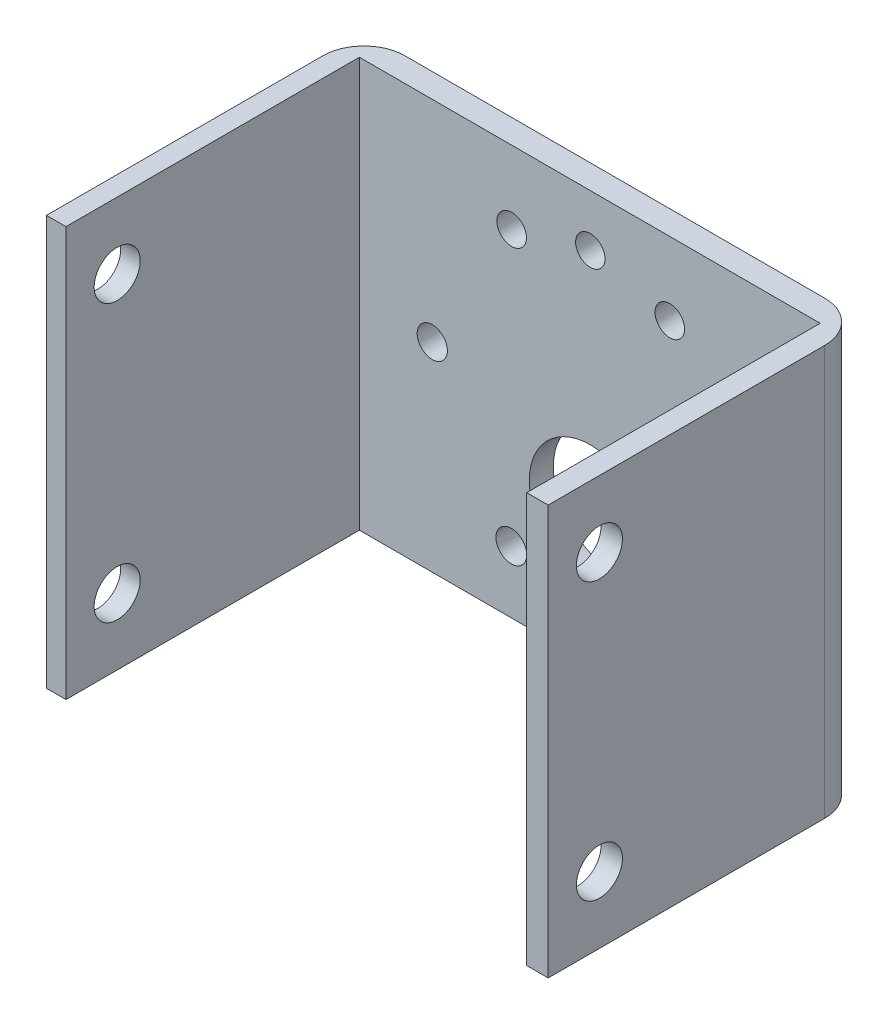
ISO-10303-21;
HEADER;
FILE_DESCRIPTION(('STEP AP214'),'2;1');
FILE_NAME('part.step','',(''),(''),'','','');
FILE_SCHEMA(('AUTOMOTIVE_DESIGN { 1 0 10303 214 1 1 1 1 }'));
ENDSEC;
DATA;
#1=APPLICATION_CONTEXT('core data for automotive mechanical design processes');
#2=APPLICATION_PROTOCOL_DEFINITION('international standard','automotive_design',2000,#1);
#3=PRODUCT_CONTEXT('',#1,'mechanical');
#4=PRODUCT('Part','Part','',(#3));
#5=PRODUCT_RELATED_PRODUCT_CATEGORY('part','',(#4));
#6=PRODUCT_DEFINITION_FORMATION('','',#4);
#7=PRODUCT_DEFINITION_CONTEXT('part definition',#1,'design');
#8=PRODUCT_DEFINITION('design','',#6,#7);
#9=PRODUCT_DEFINITION_SHAPE('','',#8);
#10=(LENGTH_UNIT() NAMED_UNIT(*) SI_UNIT(.MILLI.,.METRE.));
#11=(NAMED_UNIT(*) PLANE_ANGLE_UNIT() SI_UNIT($,.RADIAN.));
#12=(NAMED_UNIT(*) SI_UNIT($,.STERADIAN.) SOLID_ANGLE_UNIT());
#13=UNCERTAINTY_MEASURE_WITH_UNIT(LENGTH_MEASURE(1.E-05),#10,'distance_accuracy_value','');
#14=(GEOMETRIC_REPRESENTATION_CONTEXT(3) GLOBAL_UNCERTAINTY_ASSIGNED_CONTEXT((#13)) GLOBAL_UNIT_ASSIGNED_CONTEXT((#10,
#11,#12)) REPRESENTATION_CONTEXT('',''));
#15=CARTESIAN_POINT('',(0.,0.,0.));
#16=DIRECTION('',(0.,0.,1.));
#17=DIRECTION('',(1.,0.,0.));
#18=AXIS2_PLACEMENT_3D('',#15,#16,#17);
#19=CARTESIAN_POINT('',(22.2141703778084,40.,15.5));
#20=DIRECTION('',(0.,0.,-1.));
#21=DIRECTION('',(-1.,0.,0.));
#22=AXIS2_PLACEMENT_3D('',#19,#20,#21);
#23=PLANE('',#22);
#24=DIRECTION('',(1.,0.,0.));
#25=VECTOR('',#24,1.);
#26=CARTESIAN_POINT('',(22.2141703778084,40.,15.5));
#27=LINE('',#26,#25);
#28=CARTESIAN_POINT('',(22.4041703778084,40.,15.5));
#29=VERTEX_POINT('',#28);
#30=CARTESIAN_POINT('',(24.5,40.,15.5));
#31=VERTEX_POINT('',#30);
#32=EDGE_CURVE('E125',#29,#31,#27,.T.);
#33=ORIENTED_EDGE('',*,*,#32,.F.);
#34=DIRECTION('',(0.,-1.,0.));
#35=VECTOR('',#34,1.);
#36=CARTESIAN_POINT('',(22.4041703778084,463.,15.5));
#37=LINE('',#36,#35);
#38=CARTESIAN_POINT('',(22.4041703778084,0.,15.5));
#39=VERTEX_POINT('',#38);
#40=EDGE_CURVE('E135',#29,#39,#37,.T.);
#41=ORIENTED_EDGE('',*,*,#40,.T.);
#42=DIRECTION('',(1.,0.,0.));
#43=VECTOR('',#42,1.);
#44=CARTESIAN_POINT('',(22.2141703778084,0.,15.5));
#45=LINE('',#44,#43);
#46=CARTESIAN_POINT('',(24.5,0.,15.5));
#47=VERTEX_POINT('',#46);
#48=EDGE_CURVE('E140',#39,#47,#45,.T.);
#49=ORIENTED_EDGE('',*,*,#48,.T.);
#50=DIRECTION('',(0.,-1.,0.));
#51=VECTOR('',#50,1.);
#52=CARTESIAN_POINT('',(24.5,40.,15.5));
#53=LINE('',#52,#51);
#54=EDGE_CURVE('E203',#31,#47,#53,.T.);
#55=ORIENTED_EDGE('',*,*,#54,.F.);
#56=EDGE_LOOP('',(#33,#41,#49,#55));
#57=FACE_BOUND('',#56,.T.);
#58=ADVANCED_FACE('F36',(#57),#23,.F.);
#59=CARTESIAN_POINT('',(24.5,40.,-15.5));
#60=DIRECTION('',(-1.,0.,0.));
#61=DIRECTION('',(0.,0.,1.));
#62=AXIS2_PLACEMENT_3D('',#59,#60,#61);
#63=PLANE('',#62);
#64=CARTESIAN_POINT('',(24.5,6.5,10.5));
#65=DIRECTION('',(-1.,0.,0.));
#66=DIRECTION('',(0.,0.,1.));
#67=AXIS2_PLACEMENT_3D('',#64,#65,#66);
#68=CIRCLE('',#67,2.25);
#69=CARTESIAN_POINT('',(24.5,6.5,12.75));
#70=VERTEX_POINT('',#69);
#71=EDGE_CURVE('E173',#70,#70,#68,.T.);
#72=ORIENTED_EDGE('',*,*,#71,.T.);
#73=EDGE_LOOP('',(#72));
#74=FACE_BOUND('',#73,.T.);
#75=CARTESIAN_POINT('',(24.5,33.5,10.5));
#76=DIRECTION('',(-1.,0.,0.));
#77=DIRECTION('',(0.,0.,1.));
#78=AXIS2_PLACEMENT_3D('',#75,#76,#77);
#79=CIRCLE('',#78,2.25);
#80=CARTESIAN_POINT('',(24.5,33.5,12.75));
#81=VERTEX_POINT('',#80);
#82=EDGE_CURVE('E168',#81,#81,#79,.T.);
#83=ORIENTED_EDGE('',*,*,#82,.T.);
#84=EDGE_LOOP('',(#83));
#85=FACE_BOUND('',#84,.T.);
#86=DIRECTION('',(0.,0.,-1.));
#87=VECTOR('',#86,1.);
#88=CARTESIAN_POINT('',(24.5,0.,-15.5));
#89=LINE('',#88,#87);
#90=CARTESIAN_POINT('',(24.5,0.,-11.5));
#91=VERTEX_POINT('',#90);
#92=EDGE_CURVE('E191',#47,#91,#89,.T.);
#93=ORIENTED_EDGE('',*,*,#92,.T.);
#94=DIRECTION('',(0.,-1.,0.));
#95=VECTOR('',#94,1.);
#96=CARTESIAN_POINT('',(24.5,40.,-11.5));
#97=LINE('',#96,#95);
#98=CARTESIAN_POINT('',(24.5,40.,-11.5));
#99=VERTEX_POINT('',#98);
#100=EDGE_CURVE('E215',#91,#99,#97,.F.);
#101=ORIENTED_EDGE('',*,*,#100,.T.);
#102=DIRECTION('',(0.,0.,-1.));
#103=VECTOR('',#102,1.);
#104=CARTESIAN_POINT('',(24.5,40.,-15.5));
#105=LINE('',#104,#103);
#106=EDGE_CURVE('E177',#31,#99,#105,.T.);
#107=ORIENTED_EDGE('',*,*,#106,.F.);
#108=ORIENTED_EDGE('',*,*,#54,.T.);
#109=EDGE_LOOP('',(#93,#101,#107,#108));
#110=FACE_BOUND('',#109,.T.);
#111=ADVANCED_FACE('F260',(#74,#85,#110),#63,.F.);
#112=CARTESIAN_POINT('',(-24.5,40.,-15.5));
#113=DIRECTION('',(0.,0.,1.));
#114=DIRECTION('',(1.,0.,0.));
#115=AXIS2_PLACEMENT_3D('',#112,#113,#114);
#116=PLANE('',#115);
#117=CARTESIAN_POINT('',(-15.4751976460516,19.465354549289,-15.5));
#118=DIRECTION('',(0.,0.,-1.));
#119=DIRECTION('',(-1.,0.,0.));
#120=AXIS2_PLACEMENT_3D('',#117,#118,#119);
#121=CIRCLE('',#120,1.47560441927066);
#122=CARTESIAN_POINT('',(-16.9508020653222,19.465354549289,-15.5));
#123=VERTEX_POINT('',#122);
#124=EDGE_CURVE('E229',#123,#123,#121,.T.);
#125=ORIENTED_EDGE('',*,*,#124,.F.);
#126=EDGE_LOOP('',(#125));
#127=FACE_BOUND('',#126,.T.);
#128=CARTESIAN_POINT('',(-7.72259205509794,32.8759218055574,-15.5));
#129=DIRECTION('',(0.,0.,-1.));
#130=DIRECTION('',(-1.,0.,0.));
#131=AXIS2_PLACEMENT_3D('',#128,#129,#130);
#132=CIRCLE('',#131,1.44518411019594);
#133=CARTESIAN_POINT('',(-9.16777616529388,32.8759218055574,-15.5));
#134=VERTEX_POINT('',#133);
#135=EDGE_CURVE('E377',#134,#134,#132,.T.);
#136=ORIENTED_EDGE('',*,*,#135,.F.);
#137=EDGE_LOOP('',(#136));
#138=FACE_BOUND('',#137,.T.);
#139=CARTESIAN_POINT('',(7.72259205509795,32.8759218055574,-15.5));
#140=DIRECTION('',(0.,0.,-1.));
#141=DIRECTION('',(-1.,0.,0.));
#142=AXIS2_PLACEMENT_3D('',#139,#140,#141);
#143=CIRCLE('',#142,1.44518411019594);
#144=CARTESIAN_POINT('',(6.27740794490201,32.8759218055574,-15.5));
#145=VERTEX_POINT('',#144);
#146=EDGE_CURVE('E374',#145,#145,#143,.T.);
#147=ORIENTED_EDGE('',*,*,#146,.F.);
#148=EDGE_LOOP('',(#147));
#149=FACE_BOUND('',#148,.T.);
#150=CARTESIAN_POINT('',(7.7526009269815,6.07211293079628,-15.5));
#151=DIRECTION('',(0.,0.,-1.));
#152=DIRECTION('',(-1.,0.,0.));
#153=AXIS2_PLACEMENT_3D('',#150,#151,#152);
#154=CIRCLE('',#153,1.5);
#155=CARTESIAN_POINT('',(6.2526009269815,6.07211293079628,-15.5));
#156=VERTEX_POINT('',#155);
#157=EDGE_CURVE('E370',#156,#156,#154,.T.);
#158=ORIENTED_EDGE('',*,*,#157,.F.);
#159=EDGE_LOOP('',(#158));
#160=FACE_BOUND('',#159,.T.);
#161=CARTESIAN_POINT('',(15.4751976460516,19.465354549289,-15.5));
#162=DIRECTION('',(0.,0.,-1.));
#163=DIRECTION('',(-1.,0.,0.));
#164=AXIS2_PLACEMENT_3D('',#161,#162,#163);
#165=CIRCLE('',#164,1.46320376411556);
#166=CARTESIAN_POINT('',(14.011993881936,19.465354549289,-15.5));
#167=VERTEX_POINT('',#166);
#168=EDGE_CURVE('E364',#167,#167,#165,.T.);
#169=ORIENTED_EDGE('',*,*,#168,.F.);
#170=EDGE_LOOP('',(#169));
#171=FACE_BOUND('',#170,.T.);
#172=CARTESIAN_POINT('',(0.,3.99015690323744,-15.5));
#173=DIRECTION('',(0.,0.,-1.));
#174=DIRECTION('',(-1.,0.,0.));
#175=AXIS2_PLACEMENT_3D('',#172,#173,#174);
#176=CIRCLE('',#175,1.5);
#177=CARTESIAN_POINT('',(-1.49999999999999,3.99015690323744,-15.5));
#178=VERTEX_POINT('',#177);
#179=EDGE_CURVE('E367',#178,#178,#176,.T.);
#180=ORIENTED_EDGE('',*,*,#179,.F.);
#181=EDGE_LOOP('',(#180));
#182=FACE_BOUND('',#181,.T.);
#183=CARTESIAN_POINT('',(-0.0421418164080409,34.9349375124211,-15.5));
#184=DIRECTION('',(0.,0.,-1.));
#185=DIRECTION('',(-1.,0.,0.));
#186=AXIS2_PLACEMENT_3D('',#183,#184,#185);
#187=CIRCLE('',#186,1.43493751242113);
#188=CARTESIAN_POINT('',(-1.47707932882917,34.9349375124211,-15.5));
#189=VERTEX_POINT('',#188);
#190=EDGE_CURVE('E380',#189,#189,#187,.T.);
#191=ORIENTED_EDGE('',*,*,#190,.F.);
#192=EDGE_LOOP('',(#191));
#193=FACE_BOUND('',#192,.T.);
#194=CARTESIAN_POINT('',(-7.75259589553919,6.07211001837609,-15.5));
#195=DIRECTION('',(0.,0.,-1.));
#196=DIRECTION('',(-1.,0.,0.));
#197=AXIS2_PLACEMENT_3D('',#194,#195,#196);
#198=CIRCLE('',#197,1.50519179107846);
#199=CARTESIAN_POINT('',(-9.25778768661766,6.07211001837609,-15.5));
#200=VERTEX_POINT('',#199);
#201=EDGE_CURVE('E373',#200,#200,#198,.T.);
#202=ORIENTED_EDGE('',*,*,#201,.F.);
#203=EDGE_LOOP('',(#202));
#204=FACE_BOUND('',#203,.T.);
#205=CARTESIAN_POINT('',(0.,12.5,-15.5));
#206=DIRECTION('',(0.,0.,-1.));
#207=DIRECTION('',(-1.,0.,0.));
#208=AXIS2_PLACEMENT_3D('',#205,#206,#207);
#209=CIRCLE('',#208,6.);
#210=CARTESIAN_POINT('',(-6.,12.5,-15.5));
#211=VERTEX_POINT('',#210);
#212=EDGE_CURVE('E145',#211,#211,#209,.T.);
#213=ORIENTED_EDGE('',*,*,#212,.F.);
#214=EDGE_LOOP('',(#213));
#215=FACE_BOUND('',#214,.T.);
#216=DIRECTION('',(-1.,0.,0.));
#217=VECTOR('',#216,1.);
#218=CARTESIAN_POINT('',(-24.5,40.,-15.5));
#219=LINE('',#218,#217);
#220=CARTESIAN_POINT('',(20.5,40.,-15.5));
#221=VERTEX_POINT('',#220);
#222=CARTESIAN_POINT('',(-20.5,40.,-15.5));
#223=VERTEX_POINT('',#222);
#224=EDGE_CURVE('E180',#221,#223,#219,.T.);
#225=ORIENTED_EDGE('',*,*,#224,.F.);
#226=DIRECTION('',(0.,-1.,0.));
#227=VECTOR('',#226,1.);
#228=CARTESIAN_POINT('',(20.5,40.,-15.5));
#229=LINE('',#228,#227);
#230=CARTESIAN_POINT('',(20.5,0.,-15.5));
#231=VERTEX_POINT('',#230);
#232=EDGE_CURVE('E208',#221,#231,#229,.T.);
#233=ORIENTED_EDGE('',*,*,#232,.T.);
#234=DIRECTION('',(-1.,0.,0.));
#235=VECTOR('',#234,1.);
#236=CARTESIAN_POINT('',(-24.5,0.,-15.5));
#237=LINE('',#236,#235);
#238=CARTESIAN_POINT('',(-20.5,0.,-15.5));
#239=VERTEX_POINT('',#238);
#240=EDGE_CURVE('E194',#231,#239,#237,.T.);
#241=ORIENTED_EDGE('',*,*,#240,.T.);
#242=DIRECTION('',(0.,-1.,0.));
#243=VECTOR('',#242,1.);
#244=CARTESIAN_POINT('',(-20.5,40.,-15.5));
#245=LINE('',#244,#243);
#246=EDGE_CURVE('E206',#239,#223,#245,.F.);
#247=ORIENTED_EDGE('',*,*,#246,.T.);
#248=EDGE_LOOP('',(#225,#233,#241,#247));
#249=FACE_BOUND('',#248,.T.);
#250=ADVANCED_FACE('F256',(#127,#138,#149,#160,#171,#182,#193,#204,#215,#249),#116,.F.);
#251=CARTESIAN_POINT('',(-24.5,40.,-15.5));
#252=DIRECTION('',(1.,0.,0.));
#253=DIRECTION('',(0.,0.,-1.));
#254=AXIS2_PLACEMENT_3D('',#251,#252,#253);
#255=PLANE('',#254);
#256=CARTESIAN_POINT('',(-24.5,6.5,10.5));
#257=DIRECTION('',(-1.,0.,0.));
#258=DIRECTION('',(0.,0.,1.));
#259=AXIS2_PLACEMENT_3D('',#256,#257,#258);
#260=CIRCLE('',#259,2.25);
#261=CARTESIAN_POINT('',(-24.5,6.5,12.75));
#262=VERTEX_POINT('',#261);
#263=EDGE_CURVE('E165',#262,#262,#260,.T.);
#264=ORIENTED_EDGE('',*,*,#263,.F.);
#265=EDGE_LOOP('',(#264));
#266=FACE_BOUND('',#265,.T.);
#267=CARTESIAN_POINT('',(-24.5,33.5,10.5));
#268=DIRECTION('',(-1.,0.,0.));
#269=DIRECTION('',(0.,0.,1.));
#270=AXIS2_PLACEMENT_3D('',#267,#268,#269);
#271=CIRCLE('',#270,2.25);
#272=CARTESIAN_POINT('',(-24.5,33.5,12.75));
#273=VERTEX_POINT('',#272);
#274=EDGE_CURVE('E164',#273,#273,#271,.T.);
#275=ORIENTED_EDGE('',*,*,#274,.F.);
#276=EDGE_LOOP('',(#275));
#277=FACE_BOUND('',#276,.T.);
#278=DIRECTION('',(0.,0.,1.));
#279=VECTOR('',#278,1.);
#280=CARTESIAN_POINT('',(-24.5,40.,-15.5));
#281=LINE('',#280,#279);
#282=CARTESIAN_POINT('',(-24.5,40.,-11.5));
#283=VERTEX_POINT('',#282);
#284=CARTESIAN_POINT('',(-24.5,40.,15.5));
#285=VERTEX_POINT('',#284);
#286=EDGE_CURVE('E182',#283,#285,#281,.T.);
#287=ORIENTED_EDGE('',*,*,#286,.F.);
#288=DIRECTION('',(0.,-1.,0.));
#289=VECTOR('',#288,1.);
#290=CARTESIAN_POINT('',(-24.5,40.,-11.5));
#291=LINE('',#290,#289);
#292=CARTESIAN_POINT('',(-24.5,0.,-11.5));
#293=VERTEX_POINT('',#292);
#294=EDGE_CURVE('E11',#283,#293,#291,.T.);
#295=ORIENTED_EDGE('',*,*,#294,.T.);
#296=DIRECTION('',(0.,0.,1.));
#297=VECTOR('',#296,1.);
#298=CARTESIAN_POINT('',(-24.5,0.,-15.5));
#299=LINE('',#298,#297);
#300=CARTESIAN_POINT('',(-24.5,0.,15.5));
#301=VERTEX_POINT('',#300);
#302=EDGE_CURVE('E197',#293,#301,#299,.T.);
#303=ORIENTED_EDGE('',*,*,#302,.T.);
#304=DIRECTION('',(0.,-1.,0.));
#305=VECTOR('',#304,1.);
#306=CARTESIAN_POINT('',(-24.5,40.,15.5));
#307=LINE('',#306,#305);
#308=EDGE_CURVE('E189',#285,#301,#307,.T.);
#309=ORIENTED_EDGE('',*,*,#308,.F.);
#310=EDGE_LOOP('',(#287,#295,#303,#309));
#311=FACE_BOUND('',#310,.T.);
#312=ADVANCED_FACE('F259',(#266,#277,#311),#255,.F.);
#313=CARTESIAN_POINT('',(-24.5,40.,15.5));
#314=DIRECTION('',(0.,0.,-1.));
#315=DIRECTION('',(-1.,0.,0.));
#316=AXIS2_PLACEMENT_3D('',#313,#314,#315);
#317=PLANE('',#316);
#318=DIRECTION('',(1.,0.,0.));
#319=VECTOR('',#318,1.);
#320=CARTESIAN_POINT('',(-24.5,0.,15.5));
#321=LINE('',#320,#319);
#322=CARTESIAN_POINT('',(-22.5933043978458,0.,15.5));
#323=VERTEX_POINT('',#322);
#324=EDGE_CURVE('E126',#301,#323,#321,.T.);
#325=ORIENTED_EDGE('',*,*,#324,.T.);
#326=DIRECTION('',(0.,-1.,0.));
#327=VECTOR('',#326,1.);
#328=CARTESIAN_POINT('',(-22.5933043978458,463.,15.5));
#329=LINE('',#328,#327);
#330=CARTESIAN_POINT('',(-22.5933043978458,40.,15.5));
#331=VERTEX_POINT('',#330);
#332=EDGE_CURVE('E53',#331,#323,#329,.T.);
#333=ORIENTED_EDGE('',*,*,#332,.F.);
#334=DIRECTION('',(1.,0.,0.));
#335=VECTOR('',#334,1.);
#336=CARTESIAN_POINT('',(-24.5,40.,15.5));
#337=LINE('',#336,#335);
#338=EDGE_CURVE('E184',#285,#331,#337,.T.);
#339=ORIENTED_EDGE('',*,*,#338,.F.);
#340=ORIENTED_EDGE('',*,*,#308,.T.);
#341=EDGE_LOOP('',(#325,#333,#339,#340));
#342=FACE_BOUND('',#341,.T.);
#343=ADVANCED_FACE('F281',(#342),#317,.F.);
#344=CARTESIAN_POINT('',(-22.4033043978458,40.,-13.1532472954369));
#345=DIRECTION('',(0.,0.,-1.));
#346=DIRECTION('',(-1.,0.,0.));
#347=AXIS2_PLACEMENT_3D('',#344,#345,#346);
#348=PLANE('',#347);
#349=CARTESIAN_POINT('',(-15.4751976460516,19.465354549289,-13.1532472954369));
#350=DIRECTION('',(0.,0.,-1.));
#351=DIRECTION('',(-1.,0.,0.));
#352=AXIS2_PLACEMENT_3D('',#349,#350,#351);
#353=CIRCLE('',#352,1.47560441927066);
#354=CARTESIAN_POINT('',(-16.9508020653222,19.465354549289,-13.1532472954369));
#355=VERTEX_POINT('',#354);
#356=EDGE_CURVE('E40',#355,#355,#353,.T.);
#357=ORIENTED_EDGE('',*,*,#356,.T.);
#358=EDGE_LOOP('',(#357));
#359=FACE_BOUND('',#358,.T.);
#360=CARTESIAN_POINT('',(-7.72259205509794,32.8759218055574,-13.1532472954369));
#361=DIRECTION('',(0.,0.,-1.));
#362=DIRECTION('',(-1.,0.,0.));
#363=AXIS2_PLACEMENT_3D('',#360,#361,#362);
#364=CIRCLE('',#363,1.44518411019594);
#365=CARTESIAN_POINT('',(-9.16777616529388,32.8759218055574,-13.1532472954369));
#366=VERTEX_POINT('',#365);
#367=EDGE_CURVE('E243',#366,#366,#364,.T.);
#368=ORIENTED_EDGE('',*,*,#367,.T.);
#369=EDGE_LOOP('',(#368));
#370=FACE_BOUND('',#369,.T.);
#371=CARTESIAN_POINT('',(7.72259205509795,32.8759218055574,-13.1532472954369));
#372=DIRECTION('',(0.,0.,-1.));
#373=DIRECTION('',(-1.,0.,0.));
#374=AXIS2_PLACEMENT_3D('',#371,#372,#373);
#375=CIRCLE('',#374,1.44518411019594);
#376=CARTESIAN_POINT('',(6.27740794490201,32.8759218055574,-13.1532472954369));
#377=VERTEX_POINT('',#376);
#378=EDGE_CURVE('E241',#377,#377,#375,.T.);
#379=ORIENTED_EDGE('',*,*,#378,.T.);
#380=EDGE_LOOP('',(#379));
#381=FACE_BOUND('',#380,.T.);
#382=CARTESIAN_POINT('',(7.7526009269815,6.07211293079628,-13.1532472954369));
#383=DIRECTION('',(0.,0.,-1.));
#384=DIRECTION('',(-1.,0.,0.));
#385=AXIS2_PLACEMENT_3D('',#382,#383,#384);
#386=CIRCLE('',#385,1.5);
#387=CARTESIAN_POINT('',(6.2526009269815,6.07211293079628,-13.1532472954369));
#388=VERTEX_POINT('',#387);
#389=EDGE_CURVE('E238',#388,#388,#386,.T.);
#390=ORIENTED_EDGE('',*,*,#389,.T.);
#391=EDGE_LOOP('',(#390));
#392=FACE_BOUND('',#391,.T.);
#393=CARTESIAN_POINT('',(15.4751976460516,19.465354549289,-13.1532472954369));
#394=DIRECTION('',(0.,0.,-1.));
#395=DIRECTION('',(-1.,0.,0.));
#396=AXIS2_PLACEMENT_3D('',#393,#394,#395);
#397=CIRCLE('',#396,1.46320376411556);
#398=CARTESIAN_POINT('',(14.011993881936,19.465354549289,-13.1532472954369));
#399=VERTEX_POINT('',#398);
#400=EDGE_CURVE('E235',#399,#399,#397,.T.);
#401=ORIENTED_EDGE('',*,*,#400,.T.);
#402=EDGE_LOOP('',(#401));
#403=FACE_BOUND('',#402,.T.);
#404=CARTESIAN_POINT('',(0.,3.99015690323744,-13.1532472954369));
#405=DIRECTION('',(0.,0.,-1.));
#406=DIRECTION('',(-1.,0.,0.));
#407=AXIS2_PLACEMENT_3D('',#404,#405,#406);
#408=CIRCLE('',#407,1.5);
#409=CARTESIAN_POINT('',(-1.49999999999999,3.99015690323744,-13.1532472954369));
#410=VERTEX_POINT('',#409);
#411=EDGE_CURVE('E232',#410,#410,#408,.T.);
#412=ORIENTED_EDGE('',*,*,#411,.T.);
#413=EDGE_LOOP('',(#412));
#414=FACE_BOUND('',#413,.T.);
#415=CARTESIAN_POINT('',(-0.0421418164080409,34.9349375124211,-13.1532472954369));
#416=DIRECTION('',(0.,0.,-1.));
#417=DIRECTION('',(-1.,0.,0.));
#418=AXIS2_PLACEMENT_3D('',#415,#416,#417);
#419=CIRCLE('',#418,1.43493751242113);
#420=CARTESIAN_POINT('',(-1.47707932882917,34.9349375124211,-13.1532472954369));
#421=VERTEX_POINT('',#420);
#422=EDGE_CURVE('E228',#421,#421,#419,.T.);
#423=ORIENTED_EDGE('',*,*,#422,.T.);
#424=EDGE_LOOP('',(#423));
#425=FACE_BOUND('',#424,.T.);
#426=CARTESIAN_POINT('',(-7.75259589553919,6.07211001837609,-13.1532472954369));
#427=DIRECTION('',(0.,0.,-1.));
#428=DIRECTION('',(-1.,0.,0.));
#429=AXIS2_PLACEMENT_3D('',#426,#427,#428);
#430=CIRCLE('',#429,1.50519179107846);
#431=CARTESIAN_POINT('',(-9.25778768661766,6.07211001837609,-13.1532472954369));
#432=VERTEX_POINT('',#431);
#433=EDGE_CURVE('E225',#432,#432,#430,.T.);
#434=ORIENTED_EDGE('',*,*,#433,.T.);
#435=EDGE_LOOP('',(#434));
#436=FACE_BOUND('',#435,.T.);
#437=CARTESIAN_POINT('',(0.,12.5,-13.1532472954369));
#438=DIRECTION('',(0.,0.,-1.));
#439=DIRECTION('',(-1.,0.,0.));
#440=AXIS2_PLACEMENT_3D('',#437,#438,#439);
#441=CIRCLE('',#440,6.);
#442=CARTESIAN_POINT('',(-6.,12.5,-13.1532472954369));
#443=VERTEX_POINT('',#442);
#444=EDGE_CURVE('E150',#443,#443,#441,.T.);
#445=ORIENTED_EDGE('',*,*,#444,.T.);
#446=EDGE_LOOP('',(#445));
#447=FACE_BOUND('',#446,.T.);
#448=DIRECTION('',(1.,0.,0.));
#449=VECTOR('',#448,1.);
#450=CARTESIAN_POINT('',(-22.4033043978458,0.,-13.1532472954369));
#451=LINE('',#450,#449);
#452=CARTESIAN_POINT('',(-22.5933043978458,0.,-13.1532472954369));
#453=VERTEX_POINT('',#452);
#454=CARTESIAN_POINT('',(22.4041703778084,0.,-13.1532472954369));
#455=VERTEX_POINT('',#454);
#456=EDGE_CURVE('E117',#453,#455,#451,.T.);
#457=ORIENTED_EDGE('',*,*,#456,.T.);
#458=DIRECTION('',(0.,-1.,0.));
#459=VECTOR('',#458,1.);
#460=CARTESIAN_POINT('',(22.4041703778084,463.,-13.1532472954369));
#461=LINE('',#460,#459);
#462=CARTESIAN_POINT('',(22.4041703778084,40.,-13.1532472954369));
#463=VERTEX_POINT('',#462);
#464=EDGE_CURVE('E120',#463,#455,#461,.T.);
#465=ORIENTED_EDGE('',*,*,#464,.F.);
#466=DIRECTION('',(1.,0.,0.));
#467=VECTOR('',#466,1.);
#468=CARTESIAN_POINT('',(-22.4033043978458,40.,-13.1532472954369));
#469=LINE('',#468,#467);
#470=CARTESIAN_POINT('',(-22.5933043978458,40.,-13.1532472954369));
#471=VERTEX_POINT('',#470);
#472=EDGE_CURVE('E187',#471,#463,#469,.T.);
#473=ORIENTED_EDGE('',*,*,#472,.F.);
#474=DIRECTION('',(0.,-1.,0.));
#475=VECTOR('',#474,1.);
#476=CARTESIAN_POINT('',(-22.5933043978458,463.,-13.1532472954369));
#477=LINE('',#476,#475);
#478=EDGE_CURVE('E122',#471,#453,#477,.T.);
#479=ORIENTED_EDGE('',*,*,#478,.T.);
#480=EDGE_LOOP('',(#457,#465,#473,#479));
#481=FACE_BOUND('',#480,.T.);
#482=ADVANCED_FACE('F119',(#359,#370,#381,#392,#403,#414,#425,#436,#447,#481),#348,.F.);
#483=CARTESIAN_POINT('',(0.,40.,0.));
#484=DIRECTION('',(0.,-1.,0.));
#485=DIRECTION('',(0.,0.,-1.));
#486=AXIS2_PLACEMENT_3D('',#483,#484,#485);
#487=PLANE('',#486);
#488=ORIENTED_EDGE('',*,*,#472,.T.);
#489=DIRECTION('',(0.,0.,1.));
#490=VECTOR('',#489,1.);
#491=CARTESIAN_POINT('',(22.4041703778084,40.,0.));
#492=LINE('',#491,#490);
#493=EDGE_CURVE('E134',#463,#29,#492,.T.);
#494=ORIENTED_EDGE('',*,*,#493,.T.);
#495=ORIENTED_EDGE('',*,*,#32,.T.);
#496=ORIENTED_EDGE('',*,*,#106,.T.);
#497=CARTESIAN_POINT('',(20.5,40.,-11.5));
#498=DIRECTION('',(0.,-1.,0.));
#499=DIRECTION('',(0.,0.,-1.));
#500=AXIS2_PLACEMENT_3D('',#497,#498,#499);
#501=CIRCLE('',#500,4.);
#502=EDGE_CURVE('E45',#99,#221,#501,.F.);
#503=ORIENTED_EDGE('',*,*,#502,.T.);
#504=ORIENTED_EDGE('',*,*,#224,.T.);
#505=CARTESIAN_POINT('',(-20.5,40.,-11.5));
#506=DIRECTION('',(0.,-1.,0.));
#507=DIRECTION('',(0.,0.,-1.));
#508=AXIS2_PLACEMENT_3D('',#505,#506,#507);
#509=CIRCLE('',#508,4.);
#510=EDGE_CURVE('E61',#223,#283,#509,.F.);
#511=ORIENTED_EDGE('',*,*,#510,.T.);
#512=ORIENTED_EDGE('',*,*,#286,.T.);
#513=ORIENTED_EDGE('',*,*,#338,.T.);
#514=DIRECTION('',(0.,0.,-1.));
#515=VECTOR('',#514,1.);
#516=CARTESIAN_POINT('',(-22.5933043978458,40.,0.));
#517=LINE('',#516,#515);
#518=EDGE_CURVE('E156',#331,#471,#517,.T.);
#519=ORIENTED_EDGE('',*,*,#518,.T.);
#520=EDGE_LOOP('',(#488,#494,#495,#496,#503,#504,#511,#512,#513,#519));
#521=FACE_BOUND('',#520,.T.);
#522=ADVANCED_FACE('F276',(#521),#487,.F.);
#523=CARTESIAN_POINT('',(0.,0.,0.));
#524=DIRECTION('',(0.,-1.,0.));
#525=DIRECTION('',(0.,0.,-1.));
#526=AXIS2_PLACEMENT_3D('',#523,#524,#525);
#527=PLANE('',#526);
#528=DIRECTION('',(0.,0.,1.));
#529=VECTOR('',#528,1.);
#530=CARTESIAN_POINT('',(22.4041703778084,0.,-13.1532472954369));
#531=LINE('',#530,#529);
#532=EDGE_CURVE('E131',#455,#39,#531,.T.);
#533=ORIENTED_EDGE('',*,*,#532,.F.);
#534=ORIENTED_EDGE('',*,*,#456,.F.);
#535=DIRECTION('',(0.,0.,-1.));
#536=VECTOR('',#535,1.);
#537=CARTESIAN_POINT('',(-22.5933043978458,0.,-13.1532472954369));
#538=LINE('',#537,#536);
#539=EDGE_CURVE('E149',#323,#453,#538,.T.);
#540=ORIENTED_EDGE('',*,*,#539,.F.);
#541=ORIENTED_EDGE('',*,*,#324,.F.);
#542=ORIENTED_EDGE('',*,*,#302,.F.);
#543=CARTESIAN_POINT('',(-20.5,0.,-11.5));
#544=DIRECTION('',(0.,-1.,0.));
#545=DIRECTION('',(0.,0.,-1.));
#546=AXIS2_PLACEMENT_3D('',#543,#544,#545);
#547=CIRCLE('',#546,4.);
#548=EDGE_CURVE('E211',#293,#239,#547,.T.);
#549=ORIENTED_EDGE('',*,*,#548,.T.);
#550=ORIENTED_EDGE('',*,*,#240,.F.);
#551=CARTESIAN_POINT('',(20.5,0.,-11.5));
#552=DIRECTION('',(0.,-1.,0.));
#553=DIRECTION('',(0.,0.,-1.));
#554=AXIS2_PLACEMENT_3D('',#551,#552,#553);
#555=CIRCLE('',#554,4.);
#556=EDGE_CURVE('E213',#231,#91,#555,.T.);
#557=ORIENTED_EDGE('',*,*,#556,.T.);
#558=ORIENTED_EDGE('',*,*,#92,.F.);
#559=ORIENTED_EDGE('',*,*,#48,.F.);
#560=EDGE_LOOP('',(#533,#534,#540,#541,#542,#549,#550,#557,#558,#559));
#561=FACE_BOUND('',#560,.T.);
#562=ADVANCED_FACE('F138',(#561),#527,.T.);
#563=CARTESIAN_POINT('',(20.5,40.,-11.5));
#564=DIRECTION('',(0.,-1.,0.));
#565=DIRECTION('',(0.,0.,-1.));
#566=AXIS2_PLACEMENT_3D('',#563,#564,#565);
#567=CYLINDRICAL_SURFACE('',#566,4.);
#568=ORIENTED_EDGE('',*,*,#502,.F.);
#569=ORIENTED_EDGE('',*,*,#100,.F.);
#570=ORIENTED_EDGE('',*,*,#556,.F.);
#571=ORIENTED_EDGE('',*,*,#232,.F.);
#572=EDGE_LOOP('',(#568,#569,#570,#571));
#573=FACE_BOUND('',#572,.T.);
#574=ADVANCED_FACE('F269',(#573),#567,.T.);
#575=CARTESIAN_POINT('',(-20.5,40.,-11.5));
#576=DIRECTION('',(0.,-1.,0.));
#577=DIRECTION('',(0.,0.,-1.));
#578=AXIS2_PLACEMENT_3D('',#575,#576,#577);
#579=CYLINDRICAL_SURFACE('',#578,4.);
#580=ORIENTED_EDGE('',*,*,#510,.F.);
#581=ORIENTED_EDGE('',*,*,#246,.F.);
#582=ORIENTED_EDGE('',*,*,#548,.F.);
#583=ORIENTED_EDGE('',*,*,#294,.F.);
#584=EDGE_LOOP('',(#580,#581,#582,#583));
#585=FACE_BOUND('',#584,.T.);
#586=ADVANCED_FACE('F38',(#585),#579,.T.);
#587=CARTESIAN_POINT('',(51.5,33.5,10.5));
#588=DIRECTION('',(-1.,0.,0.));
#589=DIRECTION('',(0.,0.,1.));
#590=AXIS2_PLACEMENT_3D('',#587,#588,#589);
#591=CYLINDRICAL_SURFACE('',#590,2.25);
#592=CARTESIAN_POINT('',(22.4041703778084,33.5,10.5));
#593=DIRECTION('',(1.,0.,0.));
#594=DIRECTION('',(0.,0.,-1.));
#595=AXIS2_PLACEMENT_3D('',#592,#593,#594);
#596=CIRCLE('',#595,2.25);
#597=CARTESIAN_POINT('',(22.4041703778084,33.5,8.24999999999999));
#598=VERTEX_POINT('',#597);
#599=EDGE_CURVE('E160',#598,#598,#596,.F.);
#600=ORIENTED_EDGE('',*,*,#599,.T.);
#601=EDGE_LOOP('',(#600));
#602=FACE_BOUND('',#601,.T.);
#603=ORIENTED_EDGE('',*,*,#82,.F.);
#604=EDGE_LOOP('',(#603));
#605=FACE_BOUND('',#604,.T.);
#606=ADVANCED_FACE('F288',(#602,#605),#591,.F.);
#607=CARTESIAN_POINT('',(51.5,6.5,10.5));
#608=DIRECTION('',(-1.,0.,0.));
#609=DIRECTION('',(0.,0.,1.));
#610=AXIS2_PLACEMENT_3D('',#607,#608,#609);
#611=CYLINDRICAL_SURFACE('',#610,2.25);
#612=CARTESIAN_POINT('',(22.4041703778084,6.5,10.5));
#613=DIRECTION('',(1.,0.,0.));
#614=DIRECTION('',(0.,0.,-1.));
#615=AXIS2_PLACEMENT_3D('',#612,#613,#614);
#616=CIRCLE('',#615,2.25);
#617=CARTESIAN_POINT('',(22.4041703778084,6.5,8.25));
#618=VERTEX_POINT('',#617);
#619=EDGE_CURVE('E159',#618,#618,#616,.F.);
#620=ORIENTED_EDGE('',*,*,#619,.T.);
#621=EDGE_LOOP('',(#620));
#622=FACE_BOUND('',#621,.T.);
#623=ORIENTED_EDGE('',*,*,#71,.F.);
#624=EDGE_LOOP('',(#623));
#625=FACE_BOUND('',#624,.T.);
#626=ADVANCED_FACE('F293',(#622,#625),#611,.F.);
#627=CARTESIAN_POINT('',(-22.5933043978458,33.5,10.5));
#628=DIRECTION('',(-1.,0.,0.));
#629=DIRECTION('',(0.,0.,1.));
#630=AXIS2_PLACEMENT_3D('',#627,#628,#629);
#631=CIRCLE('',#630,2.25);
#632=CARTESIAN_POINT('',(-22.5933043978458,33.5,12.75));
#633=VERTEX_POINT('',#632);
#634=EDGE_CURVE('E153',#633,#633,#631,.F.);
#635=ORIENTED_EDGE('',*,*,#634,.T.);
#636=EDGE_LOOP('',(#635));
#637=FACE_BOUND('',#636,.T.);
#638=ORIENTED_EDGE('',*,*,#274,.T.);
#639=EDGE_LOOP('',(#638));
#640=FACE_BOUND('',#639,.T.);
#641=ADVANCED_FACE('F296',(#637,#640),#591,.F.);
#642=CARTESIAN_POINT('',(-22.5933043978458,6.5,10.5));
#643=DIRECTION('',(-1.,0.,0.));
#644=DIRECTION('',(0.,0.,1.));
#645=AXIS2_PLACEMENT_3D('',#642,#643,#644);
#646=CIRCLE('',#645,2.25);
#647=CARTESIAN_POINT('',(-22.5933043978458,6.5,12.75));
#648=VERTEX_POINT('',#647);
#649=EDGE_CURVE('E147',#648,#648,#646,.F.);
#650=ORIENTED_EDGE('',*,*,#649,.T.);
#651=EDGE_LOOP('',(#650));
#652=FACE_BOUND('',#651,.T.);
#653=ORIENTED_EDGE('',*,*,#263,.T.);
#654=EDGE_LOOP('',(#653));
#655=FACE_BOUND('',#654,.T.);
#656=ADVANCED_FACE('F319',(#652,#655),#611,.F.);
#657=CARTESIAN_POINT('',(-22.5933043978458,463.,-13.1532472954369));
#658=DIRECTION('',(-1.,0.,0.));
#659=DIRECTION('',(0.,0.,1.));
#660=AXIS2_PLACEMENT_3D('',#657,#658,#659);
#661=PLANE('',#660);
#662=ORIENTED_EDGE('',*,*,#649,.F.);
#663=EDGE_LOOP('',(#662));
#664=FACE_BOUND('',#663,.T.);
#665=ORIENTED_EDGE('',*,*,#634,.F.);
#666=EDGE_LOOP('',(#665));
#667=FACE_BOUND('',#666,.T.);
#668=ORIENTED_EDGE('',*,*,#332,.T.);
#669=ORIENTED_EDGE('',*,*,#539,.T.);
#670=ORIENTED_EDGE('',*,*,#478,.F.);
#671=ORIENTED_EDGE('',*,*,#518,.F.);
#672=EDGE_LOOP('',(#668,#669,#670,#671));
#673=FACE_BOUND('',#672,.T.);
#674=ADVANCED_FACE('F277',(#664,#667,#673),#661,.F.);
#675=CARTESIAN_POINT('',(22.4041703778084,463.,-13.1532472954369));
#676=DIRECTION('',(1.,0.,0.));
#677=DIRECTION('',(0.,0.,-1.));
#678=AXIS2_PLACEMENT_3D('',#675,#676,#677);
#679=PLANE('',#678);
#680=ORIENTED_EDGE('',*,*,#619,.F.);
#681=EDGE_LOOP('',(#680));
#682=FACE_BOUND('',#681,.T.);
#683=ORIENTED_EDGE('',*,*,#599,.F.);
#684=EDGE_LOOP('',(#683));
#685=FACE_BOUND('',#684,.T.);
#686=ORIENTED_EDGE('',*,*,#464,.T.);
#687=ORIENTED_EDGE('',*,*,#532,.T.);
#688=ORIENTED_EDGE('',*,*,#40,.F.);
#689=ORIENTED_EDGE('',*,*,#493,.F.);
#690=EDGE_LOOP('',(#686,#687,#688,#689));
#691=FACE_BOUND('',#690,.T.);
#692=ADVANCED_FACE('F130',(#682,#685,#691),#679,.F.);
#693=CARTESIAN_POINT('',(0.,12.5,-5.5));
#694=DIRECTION('',(0.,0.,-1.));
#695=DIRECTION('',(-1.,0.,0.));
#696=AXIS2_PLACEMENT_3D('',#693,#694,#695);
#697=CYLINDRICAL_SURFACE('',#696,6.);
#698=ORIENTED_EDGE('',*,*,#212,.T.);
#699=EDGE_LOOP('',(#698));
#700=FACE_BOUND('',#699,.T.);
#701=ORIENTED_EDGE('',*,*,#444,.F.);
#702=EDGE_LOOP('',(#701));
#703=FACE_BOUND('',#702,.T.);
#704=ADVANCED_FACE('F253',(#700,#703),#697,.F.);
#705=CARTESIAN_POINT('',(-7.75259589553919,6.07211001837609,-5.5));
#706=DIRECTION('',(0.,0.,-1.));
#707=DIRECTION('',(-1.,0.,0.));
#708=AXIS2_PLACEMENT_3D('',#705,#706,#707);
#709=CYLINDRICAL_SURFACE('',#708,1.50519179107846);
#710=ORIENTED_EDGE('',*,*,#201,.T.);
#711=EDGE_LOOP('',(#710));
#712=FACE_BOUND('',#711,.T.);
#713=ORIENTED_EDGE('',*,*,#433,.F.);
#714=EDGE_LOOP('',(#713));
#715=FACE_BOUND('',#714,.T.);
#716=ADVANCED_FACE('F328',(#712,#715),#709,.F.);
#717=CARTESIAN_POINT('',(-0.0421418164080409,34.9349375124211,-5.5));
#718=DIRECTION('',(0.,0.,-1.));
#719=DIRECTION('',(-1.,0.,0.));
#720=AXIS2_PLACEMENT_3D('',#717,#718,#719);
#721=CYLINDRICAL_SURFACE('',#720,1.43493751242113);
#722=ORIENTED_EDGE('',*,*,#190,.T.);
#723=EDGE_LOOP('',(#722));
#724=FACE_BOUND('',#723,.T.);
#725=ORIENTED_EDGE('',*,*,#422,.F.);
#726=EDGE_LOOP('',(#725));
#727=FACE_BOUND('',#726,.T.);
#728=ADVANCED_FACE('F333',(#724,#727),#721,.F.);
#729=CARTESIAN_POINT('',(0.,3.99015690323744,-5.5));
#730=DIRECTION('',(0.,0.,-1.));
#731=DIRECTION('',(-1.,0.,0.));
#732=AXIS2_PLACEMENT_3D('',#729,#730,#731);
#733=CYLINDRICAL_SURFACE('',#732,1.5);
#734=ORIENTED_EDGE('',*,*,#179,.T.);
#735=EDGE_LOOP('',(#734));
#736=FACE_BOUND('',#735,.T.);
#737=ORIENTED_EDGE('',*,*,#411,.F.);
#738=EDGE_LOOP('',(#737));
#739=FACE_BOUND('',#738,.T.);
#740=ADVANCED_FACE('F329',(#736,#739),#733,.F.);
#741=CARTESIAN_POINT('',(15.4751976460516,19.465354549289,-5.5));
#742=DIRECTION('',(0.,0.,-1.));
#743=DIRECTION('',(-1.,0.,0.));
#744=AXIS2_PLACEMENT_3D('',#741,#742,#743);
#745=CYLINDRICAL_SURFACE('',#744,1.46320376411556);
#746=ORIENTED_EDGE('',*,*,#168,.T.);
#747=EDGE_LOOP('',(#746));
#748=FACE_BOUND('',#747,.T.);
#749=ORIENTED_EDGE('',*,*,#400,.F.);
#750=EDGE_LOOP('',(#749));
#751=FACE_BOUND('',#750,.T.);
#752=ADVANCED_FACE('F332',(#748,#751),#745,.F.);
#753=CARTESIAN_POINT('',(7.7526009269815,6.07211293079628,-5.5));
#754=DIRECTION('',(0.,0.,-1.));
#755=DIRECTION('',(-1.,0.,0.));
#756=AXIS2_PLACEMENT_3D('',#753,#754,#755);
#757=CYLINDRICAL_SURFACE('',#756,1.5);
#758=ORIENTED_EDGE('',*,*,#157,.T.);
#759=EDGE_LOOP('',(#758));
#760=FACE_BOUND('',#759,.T.);
#761=ORIENTED_EDGE('',*,*,#389,.F.);
#762=EDGE_LOOP('',(#761));
#763=FACE_BOUND('',#762,.T.);
#764=ADVANCED_FACE('F337',(#760,#763),#757,.F.);
#765=CARTESIAN_POINT('',(7.72259205509795,32.8759218055574,-5.5));
#766=DIRECTION('',(0.,0.,-1.));
#767=DIRECTION('',(-1.,0.,0.));
#768=AXIS2_PLACEMENT_3D('',#765,#766,#767);
#769=CYLINDRICAL_SURFACE('',#768,1.44518411019594);
#770=ORIENTED_EDGE('',*,*,#146,.T.);
#771=EDGE_LOOP('',(#770));
#772=FACE_BOUND('',#771,.T.);
#773=ORIENTED_EDGE('',*,*,#378,.F.);
#774=EDGE_LOOP('',(#773));
#775=FACE_BOUND('',#774,.T.);
#776=ADVANCED_FACE('F349',(#772,#775),#769,.F.);
#777=CARTESIAN_POINT('',(-7.72259205509794,32.8759218055574,-5.5));
#778=DIRECTION('',(0.,0.,-1.));
#779=DIRECTION('',(-1.,0.,0.));
#780=AXIS2_PLACEMENT_3D('',#777,#778,#779);
#781=CYLINDRICAL_SURFACE('',#780,1.44518411019594);
#782=ORIENTED_EDGE('',*,*,#135,.T.);
#783=EDGE_LOOP('',(#782));
#784=FACE_BOUND('',#783,.T.);
#785=ORIENTED_EDGE('',*,*,#367,.F.);
#786=EDGE_LOOP('',(#785));
#787=FACE_BOUND('',#786,.T.);
#788=ADVANCED_FACE('F345',(#784,#787),#781,.F.);
#789=CARTESIAN_POINT('',(-15.4751976460516,19.465354549289,-5.5));
#790=DIRECTION('',(0.,0.,-1.));
#791=DIRECTION('',(-1.,0.,0.));
#792=AXIS2_PLACEMENT_3D('',#789,#790,#791);
#793=CYLINDRICAL_SURFACE('',#792,1.47560441927066);
#794=ORIENTED_EDGE('',*,*,#124,.T.);
#795=EDGE_LOOP('',(#794));
#796=FACE_BOUND('',#795,.T.);
#797=ORIENTED_EDGE('',*,*,#356,.F.);
#798=EDGE_LOOP('',(#797));
#799=FACE_BOUND('',#798,.T.);
#800=ADVANCED_FACE('F348',(#796,#799),#793,.F.);
#801=CLOSED_SHELL('',(#58,#111,#250,#312,#343,#482,#522,#562,#574,#586,#606,#626,#641,#656,#674,
#692,#704,#716,#728,#740,#752,#764,#776,#788,#800));
#802=MANIFOLD_SOLID_BREP('B2',#801);
#803=ADVANCED_BREP_SHAPE_REPRESENTATION('',(#18,#802),#14);
#804=SHAPE_DEFINITION_REPRESENTATION(#9,#803);
ENDSEC;
END-ISO-10303-21;
